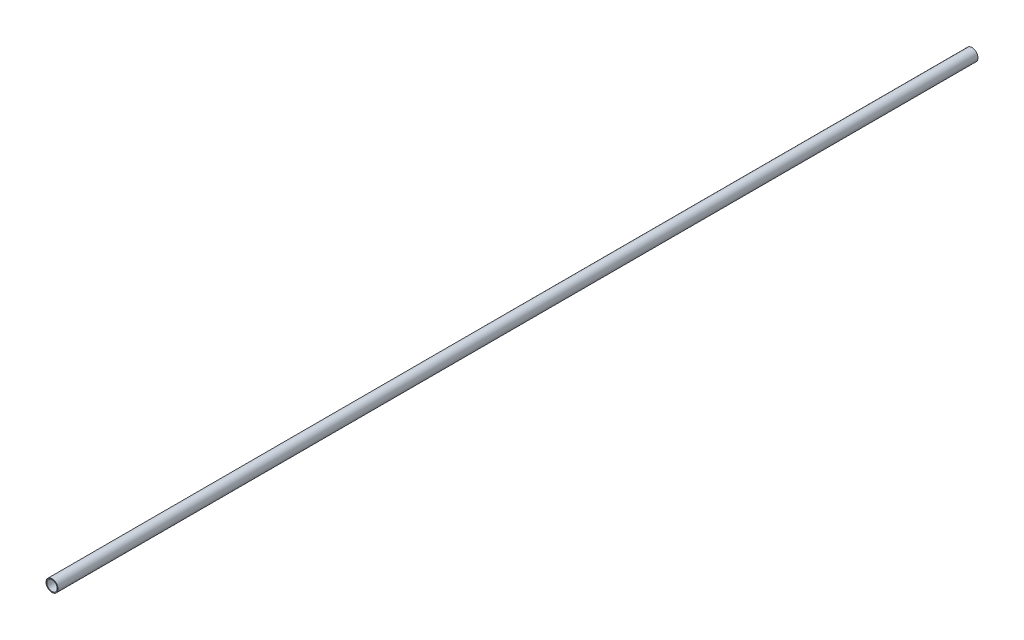
ISO-10303-21;
HEADER;
FILE_DESCRIPTION(('STEP AP214'),'2;1');
FILE_NAME('part.step','',(''),(''),'','','');
FILE_SCHEMA(('AUTOMOTIVE_DESIGN { 1 0 10303 214 1 1 1 1 }'));
ENDSEC;
DATA;
#1=APPLICATION_CONTEXT('core data for automotive mechanical design processes');
#2=APPLICATION_PROTOCOL_DEFINITION('international standard','automotive_design',2000,#1);
#3=PRODUCT_CONTEXT('',#1,'mechanical');
#4=PRODUCT('Part','Part','',(#3));
#5=PRODUCT_RELATED_PRODUCT_CATEGORY('part','',(#4));
#6=PRODUCT_DEFINITION_FORMATION('','',#4);
#7=PRODUCT_DEFINITION_CONTEXT('part definition',#1,'design');
#8=PRODUCT_DEFINITION('design','',#6,#7);
#9=PRODUCT_DEFINITION_SHAPE('','',#8);
#10=(LENGTH_UNIT() NAMED_UNIT(*) SI_UNIT(.MILLI.,.METRE.));
#11=(NAMED_UNIT(*) PLANE_ANGLE_UNIT() SI_UNIT($,.RADIAN.));
#12=(NAMED_UNIT(*) SI_UNIT($,.STERADIAN.) SOLID_ANGLE_UNIT());
#13=UNCERTAINTY_MEASURE_WITH_UNIT(LENGTH_MEASURE(1.E-05),#10,'distance_accuracy_value','');
#14=(GEOMETRIC_REPRESENTATION_CONTEXT(3) GLOBAL_UNCERTAINTY_ASSIGNED_CONTEXT((#13)) GLOBAL_UNIT_ASSIGNED_CONTEXT((#10,
#11,#12)) REPRESENTATION_CONTEXT('',''));
#15=CARTESIAN_POINT('',(0.,0.,0.));
#16=DIRECTION('',(0.,0.,1.));
#17=DIRECTION('',(1.,0.,0.));
#18=AXIS2_PLACEMENT_3D('',#15,#16,#17);
#19=CARTESIAN_POINT('',(0.,0.,976.));
#20=DIRECTION('',(0.,0.,1.));
#21=DIRECTION('',(1.,0.,0.));
#22=AXIS2_PLACEMENT_3D('',#19,#20,#21);
#23=PLANE('',#22);
#24=CARTESIAN_POINT('',(0.,0.,976.));
#25=DIRECTION('',(0.,0.,1.));
#26=DIRECTION('',(1.,0.,0.));
#27=AXIS2_PLACEMENT_3D('',#24,#25,#26);
#28=CIRCLE('',#27,6.35);
#29=CARTESIAN_POINT('',(6.35,0.,976.));
#30=VERTEX_POINT('',#29);
#31=EDGE_CURVE('E11',#30,#30,#28,.T.);
#32=ORIENTED_EDGE('',*,*,#31,.T.);
#33=EDGE_LOOP('',(#32));
#34=FACE_BOUND('',#33,.T.);
#35=CARTESIAN_POINT('',(0.,0.,976.));
#36=DIRECTION('',(0.,0.,1.));
#37=DIRECTION('',(1.,0.,0.));
#38=AXIS2_PLACEMENT_3D('',#35,#36,#37);
#39=CIRCLE('',#38,5.5);
#40=CARTESIAN_POINT('',(5.5,0.,976.));
#41=VERTEX_POINT('',#40);
#42=EDGE_CURVE('E47',#41,#41,#39,.T.);
#43=ORIENTED_EDGE('',*,*,#42,.F.);
#44=EDGE_LOOP('',(#43));
#45=FACE_BOUND('',#44,.T.);
#46=ADVANCED_FACE('F36',(#34,#45),#23,.T.);
#47=CARTESIAN_POINT('',(0.,0.,0.));
#48=DIRECTION('',(0.,0.,1.));
#49=DIRECTION('',(1.,0.,0.));
#50=AXIS2_PLACEMENT_3D('',#47,#48,#49);
#51=PLANE('',#50);
#52=CARTESIAN_POINT('',(0.,0.,0.));
#53=DIRECTION('',(0.,0.,1.));
#54=DIRECTION('',(1.,0.,0.));
#55=AXIS2_PLACEMENT_3D('',#52,#53,#54);
#56=CIRCLE('',#55,6.35);
#57=CARTESIAN_POINT('',(6.35,0.,0.));
#58=VERTEX_POINT('',#57);
#59=EDGE_CURVE('E40',#58,#58,#56,.T.);
#60=ORIENTED_EDGE('',*,*,#59,.F.);
#61=EDGE_LOOP('',(#60));
#62=FACE_BOUND('',#61,.T.);
#63=CARTESIAN_POINT('',(0.,0.,0.));
#64=DIRECTION('',(0.,0.,1.));
#65=DIRECTION('',(1.,0.,0.));
#66=AXIS2_PLACEMENT_3D('',#63,#64,#65);
#67=CIRCLE('',#66,5.5);
#68=CARTESIAN_POINT('',(5.5,0.,0.));
#69=VERTEX_POINT('',#68);
#70=EDGE_CURVE('E49',#69,#69,#67,.T.);
#71=ORIENTED_EDGE('',*,*,#70,.T.);
#72=EDGE_LOOP('',(#71));
#73=FACE_BOUND('',#72,.T.);
#74=ADVANCED_FACE('F59',(#62,#73),#51,.F.);
#75=CARTESIAN_POINT('',(0.,0.,976.));
#76=DIRECTION('',(0.,0.,-1.));
#77=DIRECTION('',(-1.,0.,0.));
#78=AXIS2_PLACEMENT_3D('',#75,#76,#77);
#79=CYLINDRICAL_SURFACE('',#78,6.35);
#80=ORIENTED_EDGE('',*,*,#31,.F.);
#81=EDGE_LOOP('',(#80));
#82=FACE_BOUND('',#81,.T.);
#83=ORIENTED_EDGE('',*,*,#59,.T.);
#84=EDGE_LOOP('',(#83));
#85=FACE_BOUND('',#84,.T.);
#86=ADVANCED_FACE('F38',(#82,#85),#79,.T.);
#87=CARTESIAN_POINT('',(0.,0.,976.));
#88=DIRECTION('',(0.,0.,-1.));
#89=DIRECTION('',(-1.,0.,0.));
#90=AXIS2_PLACEMENT_3D('',#87,#88,#89);
#91=CYLINDRICAL_SURFACE('',#90,5.5);
#92=ORIENTED_EDGE('',*,*,#42,.T.);
#93=EDGE_LOOP('',(#92));
#94=FACE_BOUND('',#93,.T.);
#95=ORIENTED_EDGE('',*,*,#70,.F.);
#96=EDGE_LOOP('',(#95));
#97=FACE_BOUND('',#96,.T.);
#98=ADVANCED_FACE('F55',(#94,#97),#91,.F.);
#99=CLOSED_SHELL('',(#46,#74,#86,#98));
#100=MANIFOLD_SOLID_BREP('B2',#99);
#101=ADVANCED_BREP_SHAPE_REPRESENTATION('',(#18,#100),#14);
#102=SHAPE_DEFINITION_REPRESENTATION(#9,#101);
ENDSEC;
END-ISO-10303-21;
